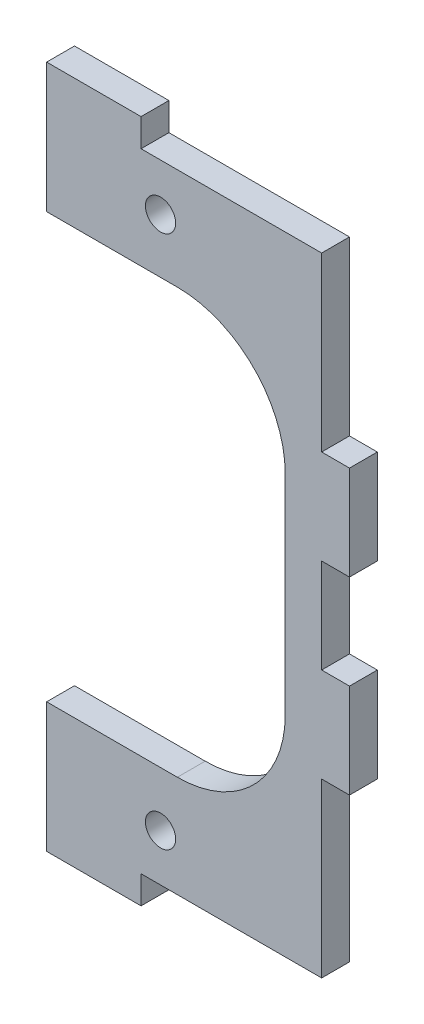
ISO-10303-21;
HEADER;
FILE_DESCRIPTION(('STEP AP214'),'2;1');
FILE_NAME('part.step','',(''),(''),'','','');
FILE_SCHEMA(('AUTOMOTIVE_DESIGN { 1 0 10303 214 1 1 1 1 }'));
ENDSEC;
DATA;
#1=APPLICATION_CONTEXT('core data for automotive mechanical design processes');
#2=APPLICATION_PROTOCOL_DEFINITION('international standard','automotive_design',2000,#1);
#3=PRODUCT_CONTEXT('',#1,'mechanical');
#4=PRODUCT('Part','Part','',(#3));
#5=PRODUCT_RELATED_PRODUCT_CATEGORY('part','',(#4));
#6=PRODUCT_DEFINITION_FORMATION('','',#4);
#7=PRODUCT_DEFINITION_CONTEXT('part definition',#1,'design');
#8=PRODUCT_DEFINITION('design','',#6,#7);
#9=PRODUCT_DEFINITION_SHAPE('','',#8);
#10=(LENGTH_UNIT() NAMED_UNIT(*) SI_UNIT(.MILLI.,.METRE.));
#11=(NAMED_UNIT(*) PLANE_ANGLE_UNIT() SI_UNIT($,.RADIAN.));
#12=(NAMED_UNIT(*) SI_UNIT($,.STERADIAN.) SOLID_ANGLE_UNIT());
#13=UNCERTAINTY_MEASURE_WITH_UNIT(LENGTH_MEASURE(1.E-05),#10,'distance_accuracy_value','');
#14=(GEOMETRIC_REPRESENTATION_CONTEXT(3) GLOBAL_UNCERTAINTY_ASSIGNED_CONTEXT((#13)) GLOBAL_UNIT_ASSIGNED_CONTEXT((#10,
#11,#12)) REPRESENTATION_CONTEXT('',''));
#15=CARTESIAN_POINT('',(0.,0.,0.));
#16=DIRECTION('',(0.,0.,1.));
#17=DIRECTION('',(1.,0.,0.));
#18=AXIS2_PLACEMENT_3D('',#15,#16,#17);
#19=CARTESIAN_POINT('',(17.065,0.,80.9979042896093));
#20=DIRECTION('',(1.,0.,0.));
#21=DIRECTION('',(0.,1.,0.));
#22=AXIS2_PLACEMENT_3D('',#19,#20,#21);
#23=PLANE('',#22);
#24=DIRECTION('',(0.,-1.,0.));
#25=VECTOR('',#24,1.);
#26=CARTESIAN_POINT('',(17.065,0.,0.));
#27=LINE('',#26,#25);
#28=CARTESIAN_POINT('',(17.065,-48.254,0.));
#29=VERTEX_POINT('',#28);
#30=CARTESIAN_POINT('',(17.065,-66.5080000000004,0.));
#31=VERTEX_POINT('',#30);
#32=EDGE_CURVE('E280',#29,#31,#27,.T.);
#33=ORIENTED_EDGE('',*,*,#32,.F.);
#34=DIRECTION('',(0.,0.,1.));
#35=VECTOR('',#34,1.);
#36=CARTESIAN_POINT('',(17.065,-48.254,80.9979042896093));
#37=LINE('',#36,#35);
#38=CARTESIAN_POINT('',(17.065,-48.254,2.95));
#39=VERTEX_POINT('',#38);
#40=EDGE_CURVE('E377',#29,#39,#37,.T.);
#41=ORIENTED_EDGE('',*,*,#40,.T.);
#42=DIRECTION('',(0.,-1.,0.));
#43=VECTOR('',#42,1.);
#44=CARTESIAN_POINT('',(17.065,0.,2.94999999999999));
#45=LINE('',#44,#43);
#46=CARTESIAN_POINT('',(17.065,-66.5080000000004,2.94999999999999));
#47=VERTEX_POINT('',#46);
#48=EDGE_CURVE('E208',#39,#47,#45,.T.);
#49=ORIENTED_EDGE('',*,*,#48,.T.);
#50=DIRECTION('',(0.,0.,-1.));
#51=VECTOR('',#50,1.);
#52=CARTESIAN_POINT('',(17.065,-66.5080000000004,80.9979042896093));
#53=LINE('',#52,#51);
#54=EDGE_CURVE('E236',#47,#31,#53,.T.);
#55=ORIENTED_EDGE('',*,*,#54,.T.);
#56=EDGE_LOOP('',(#33,#41,#49,#55));
#57=FACE_BOUND('',#56,.T.);
#58=ADVANCED_FACE('F42',(#57),#23,.T.);
#59=DIRECTION('',(0.,0.,1.));
#60=VECTOR('',#59,1.);
#61=CARTESIAN_POINT('',(17.065,-18.254,80.9979042896093));
#62=LINE('',#61,#60);
#63=CARTESIAN_POINT('',(17.065,-18.254,0.));
#64=VERTEX_POINT('',#63);
#65=CARTESIAN_POINT('',(17.065,-18.254,2.95));
#66=VERTEX_POINT('',#65);
#67=EDGE_CURVE('E372',#64,#66,#62,.T.);
#68=ORIENTED_EDGE('',*,*,#67,.F.);
#69=CARTESIAN_POINT('',(17.065,0.,0.));
#70=VERTEX_POINT('',#69);
#71=EDGE_CURVE('E275',#70,#64,#27,.T.);
#72=ORIENTED_EDGE('',*,*,#71,.F.);
#73=DIRECTION('',(0.,0.,-1.));
#74=VECTOR('',#73,1.);
#75=CARTESIAN_POINT('',(17.065,0.,80.9979042896093));
#76=LINE('',#75,#74);
#77=CARTESIAN_POINT('',(17.065,0.,2.94999999999999));
#78=VERTEX_POINT('',#77);
#79=EDGE_CURVE('E329',#78,#70,#76,.T.);
#80=ORIENTED_EDGE('',*,*,#79,.F.);
#81=EDGE_CURVE('E231',#78,#66,#45,.T.);
#82=ORIENTED_EDGE('',*,*,#81,.T.);
#83=EDGE_LOOP('',(#68,#72,#80,#82));
#84=FACE_BOUND('',#83,.T.);
#85=ADVANCED_FACE('F440',(#84),#23,.T.);
#86=CARTESIAN_POINT('',(-12.065,0.,80.9979042896093));
#87=DIRECTION('',(1.,0.,0.));
#88=DIRECTION('',(0.,1.,0.));
#89=AXIS2_PLACEMENT_3D('',#86,#87,#88);
#90=PLANE('',#89);
#91=DIRECTION('',(0.,0.,1.));
#92=VECTOR('',#91,1.);
#93=CARTESIAN_POINT('',(-12.065,-10.7737696850396,0.));
#94=LINE('',#93,#92);
#95=CARTESIAN_POINT('',(-12.065,-10.7737696850396,0.));
#96=VERTEX_POINT('',#95);
#97=CARTESIAN_POINT('',(-12.065,-10.7737696850396,2.95));
#98=VERTEX_POINT('',#97);
#99=EDGE_CURVE('E292',#96,#98,#94,.T.);
#100=ORIENTED_EDGE('',*,*,#99,.T.);
#101=DIRECTION('',(0.,-1.,0.));
#102=VECTOR('',#101,1.);
#103=CARTESIAN_POINT('',(-12.065,0.,2.94999999999999));
#104=LINE('',#103,#102);
#105=CARTESIAN_POINT('',(-12.065,2.94999999999963,2.94999999999999));
#106=VERTEX_POINT('',#105);
#107=EDGE_CURVE('E313',#106,#98,#104,.T.);
#108=ORIENTED_EDGE('',*,*,#107,.F.);
#109=DIRECTION('',(0.,0.,-1.));
#110=VECTOR('',#109,1.);
#111=CARTESIAN_POINT('',(-12.065,2.94999999999963,80.9979042896093));
#112=LINE('',#111,#110);
#113=CARTESIAN_POINT('',(-12.065,2.94999999999963,0.));
#114=VERTEX_POINT('',#113);
#115=EDGE_CURVE('E298',#106,#114,#112,.T.);
#116=ORIENTED_EDGE('',*,*,#115,.T.);
#117=DIRECTION('',(0.,-1.,0.));
#118=VECTOR('',#117,1.);
#119=CARTESIAN_POINT('',(-12.065,0.,0.));
#120=LINE('',#119,#118);
#121=EDGE_CURVE('E259',#114,#96,#120,.T.);
#122=ORIENTED_EDGE('',*,*,#121,.T.);
#123=EDGE_LOOP('',(#100,#108,#116,#122));
#124=FACE_BOUND('',#123,.T.);
#125=ADVANCED_FACE('F433',(#124),#90,.F.);
#126=CARTESIAN_POINT('',(-12.065,-55.7342303149608,2.95));
#127=VERTEX_POINT('',#126);
#128=CARTESIAN_POINT('',(-12.065,-69.4580000000003,2.94999999999999));
#129=VERTEX_POINT('',#128);
#130=EDGE_CURVE('E317',#127,#129,#104,.T.);
#131=ORIENTED_EDGE('',*,*,#130,.F.);
#132=DIRECTION('',(0.,0.,1.));
#133=VECTOR('',#132,1.);
#134=CARTESIAN_POINT('',(-12.065,-55.7342303149608,0.));
#135=LINE('',#134,#133);
#136=CARTESIAN_POINT('',(-12.065,-55.7342303149608,0.));
#137=VERTEX_POINT('',#136);
#138=EDGE_CURVE('E295',#137,#127,#135,.T.);
#139=ORIENTED_EDGE('',*,*,#138,.F.);
#140=CARTESIAN_POINT('',(-12.065,-69.4580000000003,0.));
#141=VERTEX_POINT('',#140);
#142=EDGE_CURVE('E263',#137,#141,#120,.T.);
#143=ORIENTED_EDGE('',*,*,#142,.T.);
#144=DIRECTION('',(0.,0.,-1.));
#145=VECTOR('',#144,1.);
#146=CARTESIAN_POINT('',(-12.065,-69.4580000000003,80.9979042896093));
#147=LINE('',#146,#145);
#148=EDGE_CURVE('E262',#129,#141,#147,.T.);
#149=ORIENTED_EDGE('',*,*,#148,.F.);
#150=EDGE_LOOP('',(#131,#139,#143,#149));
#151=FACE_BOUND('',#150,.T.);
#152=ADVANCED_FACE('F429',(#151),#90,.F.);
#153=CARTESIAN_POINT('',(-8.67531046999728E-13,-69.4580000000004,80.9979042896093));
#154=DIRECTION('',(0.,1.,0.));
#155=DIRECTION('',(-1.,0.,0.));
#156=AXIS2_PLACEMENT_3D('',#153,#154,#155);
#157=PLANE('',#156);
#158=DIRECTION('',(1.,0.,0.));
#159=VECTOR('',#158,1.);
#160=CARTESIAN_POINT('',(-8.70915835295278E-13,-69.4580000000004,2.94999999999999));
#161=LINE('',#160,#159);
#162=CARTESIAN_POINT('',(-2.06500000000073,-69.4580000000004,2.94999999999999));
#163=VERTEX_POINT('',#162);
#164=EDGE_CURVE('E316',#129,#163,#161,.T.);
#165=ORIENTED_EDGE('',*,*,#164,.F.);
#166=ORIENTED_EDGE('',*,*,#148,.T.);
#167=DIRECTION('',(1.,0.,0.));
#168=VECTOR('',#167,1.);
#169=CARTESIAN_POINT('',(-8.67531046999728E-13,-69.4580000000004,0.));
#170=LINE('',#169,#168);
#171=CARTESIAN_POINT('',(-2.06500000000073,-69.4580000000004,0.));
#172=VERTEX_POINT('',#171);
#173=EDGE_CURVE('E264',#141,#172,#170,.T.);
#174=ORIENTED_EDGE('',*,*,#173,.T.);
#175=DIRECTION('',(0.,0.,-1.));
#176=VECTOR('',#175,1.);
#177=CARTESIAN_POINT('',(-2.06500000000073,-69.4580000000004,80.9979042896093));
#178=LINE('',#177,#176);
#179=EDGE_CURVE('E267',#163,#172,#178,.T.);
#180=ORIENTED_EDGE('',*,*,#179,.F.);
#181=EDGE_LOOP('',(#165,#166,#174,#180));
#182=FACE_BOUND('',#181,.T.);
#183=ADVANCED_FACE('F425',(#182),#157,.F.);
#184=CARTESIAN_POINT('',(-2.06500000000001,0.,80.9979042896093));
#185=DIRECTION('',(-1.,0.,0.));
#186=DIRECTION('',(0.,-1.,0.));
#187=AXIS2_PLACEMENT_3D('',#184,#185,#186);
#188=PLANE('',#187);
#189=DIRECTION('',(0.,1.,0.));
#190=VECTOR('',#189,1.);
#191=CARTESIAN_POINT('',(-2.06500000000001,0.,2.94999999999999));
#192=LINE('',#191,#190);
#193=CARTESIAN_POINT('',(-2.0650000000007,-66.5080000000004,2.94999999999999));
#194=VERTEX_POINT('',#193);
#195=EDGE_CURVE('E430',#163,#194,#192,.T.);
#196=ORIENTED_EDGE('',*,*,#195,.F.);
#197=ORIENTED_EDGE('',*,*,#179,.T.);
#198=DIRECTION('',(0.,1.,0.));
#199=VECTOR('',#198,1.);
#200=CARTESIAN_POINT('',(-2.06500000000001,0.,0.));
#201=LINE('',#200,#199);
#202=CARTESIAN_POINT('',(-2.0650000000007,-66.5080000000004,0.));
#203=VERTEX_POINT('',#202);
#204=EDGE_CURVE('E268',#172,#203,#201,.T.);
#205=ORIENTED_EDGE('',*,*,#204,.T.);
#206=DIRECTION('',(0.,0.,-1.));
#207=VECTOR('',#206,1.);
#208=CARTESIAN_POINT('',(-2.0650000000007,-66.5080000000004,80.9979042896093));
#209=LINE('',#208,#207);
#210=EDGE_CURVE('E271',#194,#203,#209,.T.);
#211=ORIENTED_EDGE('',*,*,#210,.F.);
#212=EDGE_LOOP('',(#196,#197,#205,#211));
#213=FACE_BOUND('',#212,.T.);
#214=ADVANCED_FACE('F420',(#213),#188,.F.);
#215=CARTESIAN_POINT('',(0.,-66.5080000000004,80.9979042896093));
#216=DIRECTION('',(0.,1.,0.));
#217=DIRECTION('',(0.,0.,1.));
#218=AXIS2_PLACEMENT_3D('',#215,#216,#217);
#219=PLANE('',#218);
#220=DIRECTION('',(1.,0.,0.));
#221=VECTOR('',#220,1.);
#222=CARTESIAN_POINT('',(0.,-66.5080000000004,2.94999999999999));
#223=LINE('',#222,#221);
#224=EDGE_CURVE('E241',#194,#47,#223,.T.);
#225=ORIENTED_EDGE('',*,*,#224,.F.);
#226=ORIENTED_EDGE('',*,*,#210,.T.);
#227=DIRECTION('',(1.,0.,0.));
#228=VECTOR('',#227,1.);
#229=CARTESIAN_POINT('',(0.,-66.5080000000004,0.));
#230=LINE('',#229,#228);
#231=EDGE_CURVE('E272',#203,#31,#230,.T.);
#232=ORIENTED_EDGE('',*,*,#231,.T.);
#233=ORIENTED_EDGE('',*,*,#54,.F.);
#234=EDGE_LOOP('',(#225,#226,#232,#233));
#235=FACE_BOUND('',#234,.T.);
#236=ADVANCED_FACE('F416',(#235),#219,.F.);
#237=DIRECTION('',(0.,0.,1.));
#238=VECTOR('',#237,1.);
#239=CARTESIAN_POINT('',(17.065,-28.254,-30.9259942664945));
#240=LINE('',#239,#238);
#241=CARTESIAN_POINT('',(17.065,-28.254,0.));
#242=VERTEX_POINT('',#241);
#243=CARTESIAN_POINT('',(17.065,-28.254,2.95));
#244=VERTEX_POINT('',#243);
#245=EDGE_CURVE('E65',#242,#244,#240,.T.);
#246=ORIENTED_EDGE('',*,*,#245,.T.);
#247=CARTESIAN_POINT('',(17.065,-38.254,2.95));
#248=VERTEX_POINT('',#247);
#249=EDGE_CURVE('E237',#244,#248,#45,.T.);
#250=ORIENTED_EDGE('',*,*,#249,.T.);
#251=DIRECTION('',(0.,0.,1.));
#252=VECTOR('',#251,1.);
#253=CARTESIAN_POINT('',(17.065,-38.254,-30.9259942664945));
#254=LINE('',#253,#252);
#255=CARTESIAN_POINT('',(17.065,-38.254,0.));
#256=VERTEX_POINT('',#255);
#257=EDGE_CURVE('E388',#256,#248,#254,.T.);
#258=ORIENTED_EDGE('',*,*,#257,.F.);
#259=EDGE_CURVE('E279',#242,#256,#27,.T.);
#260=ORIENTED_EDGE('',*,*,#259,.F.);
#261=EDGE_LOOP('',(#246,#250,#258,#260));
#262=FACE_BOUND('',#261,.T.);
#263=ADVANCED_FACE('F409',(#262),#23,.T.);
#264=CARTESIAN_POINT('',(0.,0.,80.9979042896093));
#265=DIRECTION('',(0.,1.,0.));
#266=DIRECTION('',(-1.,0.,0.));
#267=AXIS2_PLACEMENT_3D('',#264,#265,#266);
#268=PLANE('',#267);
#269=DIRECTION('',(0.,0.,-1.));
#270=VECTOR('',#269,1.);
#271=CARTESIAN_POINT('',(-2.06499999999962,0.,80.9979042896093));
#272=LINE('',#271,#270);
#273=CARTESIAN_POINT('',(-2.06499999999962,0.,2.94999999999999));
#274=VERTEX_POINT('',#273);
#275=CARTESIAN_POINT('',(-2.06499999999962,0.,0.));
#276=VERTEX_POINT('',#275);
#277=EDGE_CURVE('E289',#274,#276,#272,.T.);
#278=ORIENTED_EDGE('',*,*,#277,.F.);
#279=DIRECTION('',(1.,0.,0.));
#280=VECTOR('',#279,1.);
#281=CARTESIAN_POINT('',(0.,0.,2.94999999999999));
#282=LINE('',#281,#280);
#283=EDGE_CURVE('E238',#274,#78,#282,.T.);
#284=ORIENTED_EDGE('',*,*,#283,.T.);
#285=ORIENTED_EDGE('',*,*,#79,.T.);
#286=DIRECTION('',(1.,0.,0.));
#287=VECTOR('',#286,1.);
#288=CARTESIAN_POINT('',(0.,0.,0.));
#289=LINE('',#288,#287);
#290=EDGE_CURVE('E281',#276,#70,#289,.T.);
#291=ORIENTED_EDGE('',*,*,#290,.F.);
#292=EDGE_LOOP('',(#278,#284,#285,#291));
#293=FACE_BOUND('',#292,.T.);
#294=ADVANCED_FACE('F452',(#293),#268,.T.);
#295=CARTESIAN_POINT('',(-2.06499999999962,0.,80.9979042896093));
#296=DIRECTION('',(-1.,0.,0.));
#297=DIRECTION('',(0.,-1.,0.));
#298=AXIS2_PLACEMENT_3D('',#295,#296,#297);
#299=PLANE('',#298);
#300=DIRECTION('',(0.,1.,0.));
#301=VECTOR('',#300,1.);
#302=CARTESIAN_POINT('',(-2.06499999999962,0.,2.94999999999999));
#303=LINE('',#302,#301);
#304=CARTESIAN_POINT('',(-2.06499999999959,2.94999999999963,2.94999999999999));
#305=VERTEX_POINT('',#304);
#306=EDGE_CURVE('E254',#274,#305,#303,.T.);
#307=ORIENTED_EDGE('',*,*,#306,.F.);
#308=ORIENTED_EDGE('',*,*,#277,.T.);
#309=DIRECTION('',(0.,1.,0.));
#310=VECTOR('',#309,1.);
#311=CARTESIAN_POINT('',(-2.06499999999962,0.,0.));
#312=LINE('',#311,#310);
#313=CARTESIAN_POINT('',(-2.06499999999959,2.94999999999963,0.));
#314=VERTEX_POINT('',#313);
#315=EDGE_CURVE('E285',#276,#314,#312,.T.);
#316=ORIENTED_EDGE('',*,*,#315,.T.);
#317=DIRECTION('',(0.,0.,-1.));
#318=VECTOR('',#317,1.);
#319=CARTESIAN_POINT('',(-2.06499999999959,2.94999999999963,80.9979042896093));
#320=LINE('',#319,#318);
#321=EDGE_CURVE('E288',#305,#314,#320,.T.);
#322=ORIENTED_EDGE('',*,*,#321,.F.);
#323=EDGE_LOOP('',(#307,#308,#316,#322));
#324=FACE_BOUND('',#323,.T.);
#325=ADVANCED_FACE('F457',(#324),#299,.F.);
#326=CARTESIAN_POINT('',(0.,2.94999999999963,80.9979042896093));
#327=DIRECTION('',(0.,-1.,0.));
#328=DIRECTION('',(1.,0.,0.));
#329=AXIS2_PLACEMENT_3D('',#326,#327,#328);
#330=PLANE('',#329);
#331=DIRECTION('',(-1.,0.,0.));
#332=VECTOR('',#331,1.);
#333=CARTESIAN_POINT('',(0.,2.94999999999963,2.94999999999999));
#334=LINE('',#333,#332);
#335=EDGE_CURVE('E278',#305,#106,#334,.T.);
#336=ORIENTED_EDGE('',*,*,#335,.F.);
#337=ORIENTED_EDGE('',*,*,#321,.T.);
#338=DIRECTION('',(-1.,0.,0.));
#339=VECTOR('',#338,1.);
#340=CARTESIAN_POINT('',(0.,2.94999999999963,0.));
#341=LINE('',#340,#339);
#342=EDGE_CURVE('E284',#314,#114,#341,.T.);
#343=ORIENTED_EDGE('',*,*,#342,.T.);
#344=ORIENTED_EDGE('',*,*,#115,.F.);
#345=EDGE_LOOP('',(#336,#337,#343,#344));
#346=FACE_BOUND('',#345,.T.);
#347=ADVANCED_FACE('F509',(#346),#330,.F.);
#348=CARTESIAN_POINT('',(0.,0.,0.));
#349=DIRECTION('',(0.,0.,1.));
#350=DIRECTION('',(1.,0.,0.));
#351=AXIS2_PLACEMENT_3D('',#348,#349,#350);
#352=PLANE('',#351);
#353=CARTESIAN_POINT('',(2.0829475297357E-13,-61.5080000000001,0.));
#354=DIRECTION('',(0.,0.,1.));
#355=DIRECTION('',(1.,0.,0.));
#356=AXIS2_PLACEMENT_3D('',#353,#354,#355);
#357=CIRCLE('',#356,1.6);
#358=CARTESIAN_POINT('',(1.60000000000021,-61.5080000000001,0.));
#359=VERTEX_POINT('',#358);
#360=EDGE_CURVE('E209',#359,#359,#357,.T.);
#361=ORIENTED_EDGE('',*,*,#360,.T.);
#362=EDGE_LOOP('',(#361));
#363=FACE_BOUND('',#362,.T.);
#364=CARTESIAN_POINT('',(7.98100734805685E-13,-5.00000000000066,0.));
#365=DIRECTION('',(0.,0.,1.));
#366=DIRECTION('',(1.,0.,0.));
#367=AXIS2_PLACEMENT_3D('',#364,#365,#366);
#368=CIRCLE('',#367,1.6);
#369=CARTESIAN_POINT('',(1.6000000000008,-5.00000000000066,0.));
#370=VERTEX_POINT('',#369);
#371=EDGE_CURVE('E693',#370,#370,#368,.T.);
#372=ORIENTED_EDGE('',*,*,#371,.T.);
#373=EDGE_LOOP('',(#372));
#374=FACE_BOUND('',#373,.T.);
#375=ORIENTED_EDGE('',*,*,#71,.T.);
#376=DIRECTION('',(1.,0.,0.));
#377=VECTOR('',#376,1.);
#378=CARTESIAN_POINT('',(0.,-18.254,0.));
#379=LINE('',#378,#377);
#380=CARTESIAN_POINT('',(20.015,-18.254,0.));
#381=VERTEX_POINT('',#380);
#382=EDGE_CURVE('E707',#64,#381,#379,.T.);
#383=ORIENTED_EDGE('',*,*,#382,.T.);
#384=DIRECTION('',(0.,-1.,0.));
#385=VECTOR('',#384,1.);
#386=CARTESIAN_POINT('',(20.015,0.,0.));
#387=LINE('',#386,#385);
#388=CARTESIAN_POINT('',(20.015,-28.254,0.));
#389=VERTEX_POINT('',#388);
#390=EDGE_CURVE('E705',#381,#389,#387,.T.);
#391=ORIENTED_EDGE('',*,*,#390,.T.);
#392=DIRECTION('',(-1.,0.,0.));
#393=VECTOR('',#392,1.);
#394=CARTESIAN_POINT('',(0.,-28.254,0.));
#395=LINE('',#394,#393);
#396=EDGE_CURVE('E703',#389,#242,#395,.T.);
#397=ORIENTED_EDGE('',*,*,#396,.T.);
#398=ORIENTED_EDGE('',*,*,#259,.T.);
#399=DIRECTION('',(1.,0.,0.));
#400=VECTOR('',#399,1.);
#401=CARTESIAN_POINT('',(0.,-38.254,0.));
#402=LINE('',#401,#400);
#403=CARTESIAN_POINT('',(20.015,-38.254,0.));
#404=VERTEX_POINT('',#403);
#405=EDGE_CURVE('E394',#256,#404,#402,.T.);
#406=ORIENTED_EDGE('',*,*,#405,.T.);
#407=DIRECTION('',(0.,-1.,0.));
#408=VECTOR('',#407,1.);
#409=CARTESIAN_POINT('',(20.015,0.,0.));
#410=LINE('',#409,#408);
#411=CARTESIAN_POINT('',(20.015,-48.254,0.));
#412=VERTEX_POINT('',#411);
#413=EDGE_CURVE('E382',#404,#412,#410,.T.);
#414=ORIENTED_EDGE('',*,*,#413,.T.);
#415=DIRECTION('',(1.,0.,0.));
#416=VECTOR('',#415,1.);
#417=CARTESIAN_POINT('',(0.,-48.254,0.));
#418=LINE('',#417,#416);
#419=EDGE_CURVE('E57',#29,#412,#418,.T.);
#420=ORIENTED_EDGE('',*,*,#419,.F.);
#421=ORIENTED_EDGE('',*,*,#32,.T.);
#422=ORIENTED_EDGE('',*,*,#231,.F.);
#423=ORIENTED_EDGE('',*,*,#204,.F.);
#424=ORIENTED_EDGE('',*,*,#173,.F.);
#425=ORIENTED_EDGE('',*,*,#142,.F.);
#426=DIRECTION('',(1.,0.,0.));
#427=VECTOR('',#426,1.);
#428=CARTESIAN_POINT('',(0.,-55.7342303149608,0.));
#429=LINE('',#428,#427);
#430=CARTESIAN_POINT('',(1.778,-55.7342303149608,0.));
#431=VERTEX_POINT('',#430);
#432=EDGE_CURVE('E296',#137,#431,#429,.T.);
#433=ORIENTED_EDGE('',*,*,#432,.T.);
#434=CARTESIAN_POINT('',(1.778,-44.3042303149608,0.));
#435=DIRECTION('',(0.,0.,1.));
#436=DIRECTION('',(1.,0.,0.));
#437=AXIS2_PLACEMENT_3D('',#434,#435,#436);
#438=CIRCLE('',#437,11.43);
#439=CARTESIAN_POINT('',(13.208,-44.3042303149608,0.));
#440=VERTEX_POINT('',#439);
#441=EDGE_CURVE('E12',#431,#440,#438,.T.);
#442=ORIENTED_EDGE('',*,*,#441,.T.);
#443=DIRECTION('',(0.,-1.,0.));
#444=VECTOR('',#443,1.);
#445=CARTESIAN_POINT('',(13.208,0.,0.));
#446=LINE('',#445,#444);
#447=CARTESIAN_POINT('',(13.208,-22.2037696850396,0.));
#448=VERTEX_POINT('',#447);
#449=EDGE_CURVE('E302',#448,#440,#446,.T.);
#450=ORIENTED_EDGE('',*,*,#449,.F.);
#451=CARTESIAN_POINT('',(1.778,-22.2037696850396,0.));
#452=DIRECTION('',(0.,0.,1.));
#453=DIRECTION('',(1.,0.,0.));
#454=AXIS2_PLACEMENT_3D('',#451,#452,#453);
#455=CIRCLE('',#454,11.43);
#456=CARTESIAN_POINT('',(1.778,-10.7737696850396,0.));
#457=VERTEX_POINT('',#456);
#458=EDGE_CURVE('E345',#448,#457,#455,.T.);
#459=ORIENTED_EDGE('',*,*,#458,.T.);
#460=DIRECTION('',(1.,0.,0.));
#461=VECTOR('',#460,1.);
#462=CARTESIAN_POINT('',(0.,-10.7737696850396,0.));
#463=LINE('',#462,#461);
#464=EDGE_CURVE('E367',#96,#457,#463,.T.);
#465=ORIENTED_EDGE('',*,*,#464,.F.);
#466=ORIENTED_EDGE('',*,*,#121,.F.);
#467=ORIENTED_EDGE('',*,*,#342,.F.);
#468=ORIENTED_EDGE('',*,*,#315,.F.);
#469=ORIENTED_EDGE('',*,*,#290,.T.);
#470=EDGE_LOOP('',(#375,#383,#391,#397,#398,#406,#414,#420,#421,#422,#423,#424,#425,#433,#442,
#450,#459,#465,#466,#467,#468,#469));
#471=FACE_BOUND('',#470,.T.);
#472=ADVANCED_FACE('F361',(#363,#374,#471),#352,.F.);
#473=CARTESIAN_POINT('',(-12.0649999999996,2.94999999999973,2.95));
#474=DIRECTION('',(0.,0.,1.));
#475=DIRECTION('',(1.,0.,0.));
#476=AXIS2_PLACEMENT_3D('',#473,#474,#475);
#477=PLANE('',#476);
#478=CARTESIAN_POINT('',(2.0829475297357E-13,-61.5080000000001,2.95));
#479=DIRECTION('',(0.,0.,1.));
#480=DIRECTION('',(1.,0.,0.));
#481=AXIS2_PLACEMENT_3D('',#478,#479,#480);
#482=CIRCLE('',#481,1.6);
#483=CARTESIAN_POINT('',(1.60000000000021,-61.5080000000001,2.95));
#484=VERTEX_POINT('',#483);
#485=EDGE_CURVE('E692',#484,#484,#482,.T.);
#486=ORIENTED_EDGE('',*,*,#485,.F.);
#487=EDGE_LOOP('',(#486));
#488=FACE_BOUND('',#487,.T.);
#489=CARTESIAN_POINT('',(7.98100734805685E-13,-5.00000000000066,2.95));
#490=DIRECTION('',(0.,0.,1.));
#491=DIRECTION('',(1.,0.,0.));
#492=AXIS2_PLACEMENT_3D('',#489,#490,#491);
#493=CIRCLE('',#492,1.6);
#494=CARTESIAN_POINT('',(1.6000000000008,-5.00000000000066,2.95));
#495=VERTEX_POINT('',#494);
#496=EDGE_CURVE('E697',#495,#495,#493,.T.);
#497=ORIENTED_EDGE('',*,*,#496,.F.);
#498=EDGE_LOOP('',(#497));
#499=FACE_BOUND('',#498,.T.);
#500=CARTESIAN_POINT('',(1.778,-22.2037696850396,2.95));
#501=DIRECTION('',(0.,0.,1.));
#502=DIRECTION('',(1.,0.,0.));
#503=AXIS2_PLACEMENT_3D('',#500,#501,#502);
#504=CIRCLE('',#503,11.43);
#505=CARTESIAN_POINT('',(1.778,-10.7737696850396,2.95));
#506=VERTEX_POINT('',#505);
#507=CARTESIAN_POINT('',(13.208,-22.2037696850396,2.95));
#508=VERTEX_POINT('',#507);
#509=EDGE_CURVE('E343',#506,#508,#504,.F.);
#510=ORIENTED_EDGE('',*,*,#509,.T.);
#511=DIRECTION('',(0.,-1.,0.));
#512=VECTOR('',#511,1.);
#513=CARTESIAN_POINT('',(13.208,0.,2.95));
#514=LINE('',#513,#512);
#515=CARTESIAN_POINT('',(13.208,-44.3042303149608,2.95));
#516=VERTEX_POINT('',#515);
#517=EDGE_CURVE('E350',#508,#516,#514,.T.);
#518=ORIENTED_EDGE('',*,*,#517,.T.);
#519=CARTESIAN_POINT('',(1.778,-44.3042303149608,2.95));
#520=DIRECTION('',(0.,0.,1.));
#521=DIRECTION('',(1.,0.,0.));
#522=AXIS2_PLACEMENT_3D('',#519,#520,#521);
#523=CIRCLE('',#522,11.43);
#524=CARTESIAN_POINT('',(1.778,-55.7342303149608,2.95));
#525=VERTEX_POINT('',#524);
#526=EDGE_CURVE('E50',#516,#525,#523,.F.);
#527=ORIENTED_EDGE('',*,*,#526,.T.);
#528=DIRECTION('',(1.,0.,0.));
#529=VECTOR('',#528,1.);
#530=CARTESIAN_POINT('',(0.,-55.7342303149608,2.95));
#531=LINE('',#530,#529);
#532=EDGE_CURVE('E299',#127,#525,#531,.T.);
#533=ORIENTED_EDGE('',*,*,#532,.F.);
#534=ORIENTED_EDGE('',*,*,#130,.T.);
#535=ORIENTED_EDGE('',*,*,#164,.T.);
#536=ORIENTED_EDGE('',*,*,#195,.T.);
#537=ORIENTED_EDGE('',*,*,#224,.T.);
#538=ORIENTED_EDGE('',*,*,#48,.F.);
#539=DIRECTION('',(-1.,0.,0.));
#540=VECTOR('',#539,1.);
#541=CARTESIAN_POINT('',(0.,-48.254,2.95));
#542=LINE('',#541,#540);
#543=CARTESIAN_POINT('',(20.015,-48.254,2.95));
#544=VERTEX_POINT('',#543);
#545=EDGE_CURVE('E193',#544,#39,#542,.T.);
#546=ORIENTED_EDGE('',*,*,#545,.F.);
#547=DIRECTION('',(0.,1.,0.));
#548=VECTOR('',#547,1.);
#549=CARTESIAN_POINT('',(20.015,0.,2.95));
#550=LINE('',#549,#548);
#551=CARTESIAN_POINT('',(20.015,-38.254,2.95));
#552=VERTEX_POINT('',#551);
#553=EDGE_CURVE('E206',#544,#552,#550,.T.);
#554=ORIENTED_EDGE('',*,*,#553,.T.);
#555=DIRECTION('',(-1.,0.,0.));
#556=VECTOR('',#555,1.);
#557=CARTESIAN_POINT('',(0.,-38.254,2.95));
#558=LINE('',#557,#556);
#559=EDGE_CURVE('E214',#552,#248,#558,.T.);
#560=ORIENTED_EDGE('',*,*,#559,.T.);
#561=ORIENTED_EDGE('',*,*,#249,.F.);
#562=DIRECTION('',(1.,0.,0.));
#563=VECTOR('',#562,1.);
#564=CARTESIAN_POINT('',(0.,-28.254,2.95));
#565=LINE('',#564,#563);
#566=CARTESIAN_POINT('',(20.015,-28.254,2.95));
#567=VERTEX_POINT('',#566);
#568=EDGE_CURVE('E216',#244,#567,#565,.T.);
#569=ORIENTED_EDGE('',*,*,#568,.T.);
#570=DIRECTION('',(0.,1.,0.));
#571=VECTOR('',#570,1.);
#572=CARTESIAN_POINT('',(20.015,0.,2.95));
#573=LINE('',#572,#571);
#574=CARTESIAN_POINT('',(20.015,-18.254,2.95));
#575=VERTEX_POINT('',#574);
#576=EDGE_CURVE('E397',#567,#575,#573,.T.);
#577=ORIENTED_EDGE('',*,*,#576,.T.);
#578=DIRECTION('',(-1.,0.,0.));
#579=VECTOR('',#578,1.);
#580=CARTESIAN_POINT('',(0.,-18.254,2.95));
#581=LINE('',#580,#579);
#582=EDGE_CURVE('E199',#575,#66,#581,.T.);
#583=ORIENTED_EDGE('',*,*,#582,.T.);
#584=ORIENTED_EDGE('',*,*,#81,.F.);
#585=ORIENTED_EDGE('',*,*,#283,.F.);
#586=ORIENTED_EDGE('',*,*,#306,.T.);
#587=ORIENTED_EDGE('',*,*,#335,.T.);
#588=ORIENTED_EDGE('',*,*,#107,.T.);
#589=DIRECTION('',(1.,0.,0.));
#590=VECTOR('',#589,1.);
#591=CARTESIAN_POINT('',(0.,-10.7737696850396,2.95));
#592=LINE('',#591,#590);
#593=EDGE_CURVE('E303',#98,#506,#592,.T.);
#594=ORIENTED_EDGE('',*,*,#593,.T.);
#595=EDGE_LOOP('',(#510,#518,#527,#533,#534,#535,#536,#537,#538,#546,#554,#560,#561,#569,#577,
#583,#584,#585,#586,#587,#588,#594));
#596=FACE_BOUND('',#595,.T.);
#597=ADVANCED_FACE('F204',(#488,#499,#596),#477,.T.);
#598=CARTESIAN_POINT('',(13.208,0.,0.));
#599=DIRECTION('',(-1.,0.,0.));
#600=DIRECTION('',(0.,-1.,0.));
#601=AXIS2_PLACEMENT_3D('',#598,#599,#600);
#602=PLANE('',#601);
#603=ORIENTED_EDGE('',*,*,#517,.F.);
#604=DIRECTION('',(0.,0.,1.));
#605=VECTOR('',#604,1.);
#606=CARTESIAN_POINT('',(13.208,-22.2037696850396,0.));
#607=LINE('',#606,#605);
#608=EDGE_CURVE('E339',#508,#448,#607,.F.);
#609=ORIENTED_EDGE('',*,*,#608,.T.);
#610=ORIENTED_EDGE('',*,*,#449,.T.);
#611=DIRECTION('',(0.,0.,1.));
#612=VECTOR('',#611,1.);
#613=CARTESIAN_POINT('',(13.208,-44.3042303149608,0.));
#614=LINE('',#613,#612);
#615=EDGE_CURVE('E336',#440,#516,#614,.T.);
#616=ORIENTED_EDGE('',*,*,#615,.T.);
#617=EDGE_LOOP('',(#603,#609,#610,#616));
#618=FACE_BOUND('',#617,.T.);
#619=ADVANCED_FACE('F365',(#618),#602,.T.);
#620=CARTESIAN_POINT('',(0.,-55.7342303149608,0.));
#621=DIRECTION('',(0.,-1.,0.));
#622=DIRECTION('',(0.,0.,-1.));
#623=AXIS2_PLACEMENT_3D('',#620,#621,#622);
#624=PLANE('',#623);
#625=ORIENTED_EDGE('',*,*,#532,.T.);
#626=DIRECTION('',(0.,0.,1.));
#627=VECTOR('',#626,1.);
#628=CARTESIAN_POINT('',(1.778,-55.7342303149608,0.));
#629=LINE('',#628,#627);
#630=EDGE_CURVE('E341',#525,#431,#629,.F.);
#631=ORIENTED_EDGE('',*,*,#630,.T.);
#632=ORIENTED_EDGE('',*,*,#432,.F.);
#633=ORIENTED_EDGE('',*,*,#138,.T.);
#634=EDGE_LOOP('',(#625,#631,#632,#633));
#635=FACE_BOUND('',#634,.T.);
#636=ADVANCED_FACE('F355',(#635),#624,.F.);
#637=CARTESIAN_POINT('',(0.,-10.7737696850396,0.));
#638=DIRECTION('',(0.,-1.,0.));
#639=DIRECTION('',(0.,0.,-1.));
#640=AXIS2_PLACEMENT_3D('',#637,#638,#639);
#641=PLANE('',#640);
#642=ORIENTED_EDGE('',*,*,#464,.T.);
#643=DIRECTION('',(0.,0.,1.));
#644=VECTOR('',#643,1.);
#645=CARTESIAN_POINT('',(1.778,-10.7737696850396,2.95));
#646=LINE('',#645,#644);
#647=EDGE_CURVE('E258',#457,#506,#646,.T.);
#648=ORIENTED_EDGE('',*,*,#647,.T.);
#649=ORIENTED_EDGE('',*,*,#593,.F.);
#650=ORIENTED_EDGE('',*,*,#99,.F.);
#651=EDGE_LOOP('',(#642,#648,#649,#650));
#652=FACE_BOUND('',#651,.T.);
#653=ADVANCED_FACE('F567',(#652),#641,.T.);
#654=CARTESIAN_POINT('',(1.778,-22.2037696850396,0.));
#655=DIRECTION('',(0.,0.,-1.));
#656=DIRECTION('',(-1.,0.,0.));
#657=AXIS2_PLACEMENT_3D('',#654,#655,#656);
#658=CYLINDRICAL_SURFACE('',#657,11.43);
#659=ORIENTED_EDGE('',*,*,#647,.F.);
#660=ORIENTED_EDGE('',*,*,#458,.F.);
#661=ORIENTED_EDGE('',*,*,#608,.F.);
#662=ORIENTED_EDGE('',*,*,#509,.F.);
#663=EDGE_LOOP('',(#659,#660,#661,#662));
#664=FACE_BOUND('',#663,.T.);
#665=ADVANCED_FACE('F575',(#664),#658,.F.);
#666=CARTESIAN_POINT('',(1.778,-44.3042303149608,0.));
#667=DIRECTION('',(0.,0.,1.));
#668=DIRECTION('',(1.,0.,0.));
#669=AXIS2_PLACEMENT_3D('',#666,#667,#668);
#670=CYLINDRICAL_SURFACE('',#669,11.43);
#671=ORIENTED_EDGE('',*,*,#615,.F.);
#672=ORIENTED_EDGE('',*,*,#441,.F.);
#673=ORIENTED_EDGE('',*,*,#630,.F.);
#674=ORIENTED_EDGE('',*,*,#526,.F.);
#675=EDGE_LOOP('',(#671,#672,#673,#674));
#676=FACE_BOUND('',#675,.T.);
#677=ADVANCED_FACE('F44',(#676),#670,.F.);
#678=CARTESIAN_POINT('',(20.015,0.,-30.9259942664945));
#679=DIRECTION('',(1.,0.,0.));
#680=DIRECTION('',(0.,0.,-1.));
#681=AXIS2_PLACEMENT_3D('',#678,#679,#680);
#682=PLANE('',#681);
#683=ORIENTED_EDGE('',*,*,#413,.F.);
#684=DIRECTION('',(0.,0.,1.));
#685=VECTOR('',#684,1.);
#686=CARTESIAN_POINT('',(20.015,-38.254,-30.9259942664945));
#687=LINE('',#686,#685);
#688=EDGE_CURVE('E198',#404,#552,#687,.T.);
#689=ORIENTED_EDGE('',*,*,#688,.T.);
#690=ORIENTED_EDGE('',*,*,#553,.F.);
#691=DIRECTION('',(0.,0.,1.));
#692=VECTOR('',#691,1.);
#693=CARTESIAN_POINT('',(20.015,-48.254,-30.9259942664945));
#694=LINE('',#693,#692);
#695=EDGE_CURVE('E190',#412,#544,#694,.T.);
#696=ORIENTED_EDGE('',*,*,#695,.F.);
#697=EDGE_LOOP('',(#683,#689,#690,#696));
#698=FACE_BOUND('',#697,.T.);
#699=ADVANCED_FACE('F211',(#698),#682,.T.);
#700=CARTESIAN_POINT('',(0.,-38.254,-30.9259942664945));
#701=DIRECTION('',(0.,1.,0.));
#702=DIRECTION('',(0.,0.,1.));
#703=AXIS2_PLACEMENT_3D('',#700,#701,#702);
#704=PLANE('',#703);
#705=ORIENTED_EDGE('',*,*,#405,.F.);
#706=ORIENTED_EDGE('',*,*,#257,.T.);
#707=ORIENTED_EDGE('',*,*,#559,.F.);
#708=ORIENTED_EDGE('',*,*,#688,.F.);
#709=EDGE_LOOP('',(#705,#706,#707,#708));
#710=FACE_BOUND('',#709,.T.);
#711=ADVANCED_FACE('F611',(#710),#704,.T.);
#712=CARTESIAN_POINT('',(0.,-48.254,-30.9259942664945));
#713=DIRECTION('',(0.,1.,0.));
#714=DIRECTION('',(-1.,0.,0.));
#715=AXIS2_PLACEMENT_3D('',#712,#713,#714);
#716=PLANE('',#715);
#717=ORIENTED_EDGE('',*,*,#40,.F.);
#718=ORIENTED_EDGE('',*,*,#419,.T.);
#719=ORIENTED_EDGE('',*,*,#695,.T.);
#720=ORIENTED_EDGE('',*,*,#545,.T.);
#721=EDGE_LOOP('',(#717,#718,#719,#720));
#722=FACE_BOUND('',#721,.T.);
#723=ADVANCED_FACE('F192',(#722),#716,.F.);
#724=CARTESIAN_POINT('',(0.,-18.254,-30.9259942664945));
#725=DIRECTION('',(0.,1.,0.));
#726=DIRECTION('',(0.,0.,1.));
#727=AXIS2_PLACEMENT_3D('',#724,#725,#726);
#728=PLANE('',#727);
#729=ORIENTED_EDGE('',*,*,#382,.F.);
#730=ORIENTED_EDGE('',*,*,#67,.T.);
#731=ORIENTED_EDGE('',*,*,#582,.F.);
#732=DIRECTION('',(0.,0.,1.));
#733=VECTOR('',#732,1.);
#734=CARTESIAN_POINT('',(20.015,-18.254,-30.9259942664945));
#735=LINE('',#734,#733);
#736=EDGE_CURVE('E393',#381,#575,#735,.T.);
#737=ORIENTED_EDGE('',*,*,#736,.F.);
#738=EDGE_LOOP('',(#729,#730,#731,#737));
#739=FACE_BOUND('',#738,.T.);
#740=ADVANCED_FACE('F631',(#739),#728,.T.);
#741=CARTESIAN_POINT('',(20.015,0.,-30.9259942664945));
#742=DIRECTION('',(1.,0.,0.));
#743=DIRECTION('',(0.,0.,-1.));
#744=AXIS2_PLACEMENT_3D('',#741,#742,#743);
#745=PLANE('',#744);
#746=ORIENTED_EDGE('',*,*,#390,.F.);
#747=ORIENTED_EDGE('',*,*,#736,.T.);
#748=ORIENTED_EDGE('',*,*,#576,.F.);
#749=DIRECTION('',(0.,0.,1.));
#750=VECTOR('',#749,1.);
#751=CARTESIAN_POINT('',(20.015,-28.254,-30.9259942664945));
#752=LINE('',#751,#750);
#753=EDGE_CURVE('E391',#389,#567,#752,.T.);
#754=ORIENTED_EDGE('',*,*,#753,.F.);
#755=EDGE_LOOP('',(#746,#747,#748,#754));
#756=FACE_BOUND('',#755,.T.);
#757=ADVANCED_FACE('F641',(#756),#745,.T.);
#758=CARTESIAN_POINT('',(0.,-28.254,-30.9259942664945));
#759=DIRECTION('',(0.,-1.,0.));
#760=DIRECTION('',(0.,0.,-1.));
#761=AXIS2_PLACEMENT_3D('',#758,#759,#760);
#762=PLANE('',#761);
#763=ORIENTED_EDGE('',*,*,#396,.F.);
#764=ORIENTED_EDGE('',*,*,#753,.T.);
#765=ORIENTED_EDGE('',*,*,#568,.F.);
#766=ORIENTED_EDGE('',*,*,#245,.F.);
#767=EDGE_LOOP('',(#763,#764,#765,#766));
#768=FACE_BOUND('',#767,.T.);
#769=ADVANCED_FACE('F405',(#768),#762,.T.);
#770=CARTESIAN_POINT('',(7.98100734805685E-13,-5.00000000000066,0.));
#771=DIRECTION('',(0.,0.,1.));
#772=DIRECTION('',(1.,0.,0.));
#773=AXIS2_PLACEMENT_3D('',#770,#771,#772);
#774=CYLINDRICAL_SURFACE('',#773,1.6);
#775=ORIENTED_EDGE('',*,*,#371,.F.);
#776=EDGE_LOOP('',(#775));
#777=FACE_BOUND('',#776,.T.);
#778=ORIENTED_EDGE('',*,*,#496,.T.);
#779=EDGE_LOOP('',(#778));
#780=FACE_BOUND('',#779,.T.);
#781=ADVANCED_FACE('F658',(#777,#780),#774,.F.);
#782=CARTESIAN_POINT('',(2.0829475297357E-13,-61.5080000000001,0.));
#783=DIRECTION('',(0.,0.,1.));
#784=DIRECTION('',(1.,0.,0.));
#785=AXIS2_PLACEMENT_3D('',#782,#783,#784);
#786=CYLINDRICAL_SURFACE('',#785,1.6);
#787=ORIENTED_EDGE('',*,*,#360,.F.);
#788=EDGE_LOOP('',(#787));
#789=FACE_BOUND('',#788,.T.);
#790=ORIENTED_EDGE('',*,*,#485,.T.);
#791=EDGE_LOOP('',(#790));
#792=FACE_BOUND('',#791,.T.);
#793=ADVANCED_FACE('F673',(#789,#792),#786,.F.);
#794=CLOSED_SHELL('',(#58,#85,#125,#152,#183,#214,#236,#263,#294,#325,#347,#472,#597,#619,#636,
#653,#665,#677,#699,#711,#723,#740,#757,#769,#781,#793));
#795=MANIFOLD_SOLID_BREP('B2',#794);
#796=ADVANCED_BREP_SHAPE_REPRESENTATION('',(#18,#795),#14);
#797=SHAPE_DEFINITION_REPRESENTATION(#9,#796);
ENDSEC;
END-ISO-10303-21;
